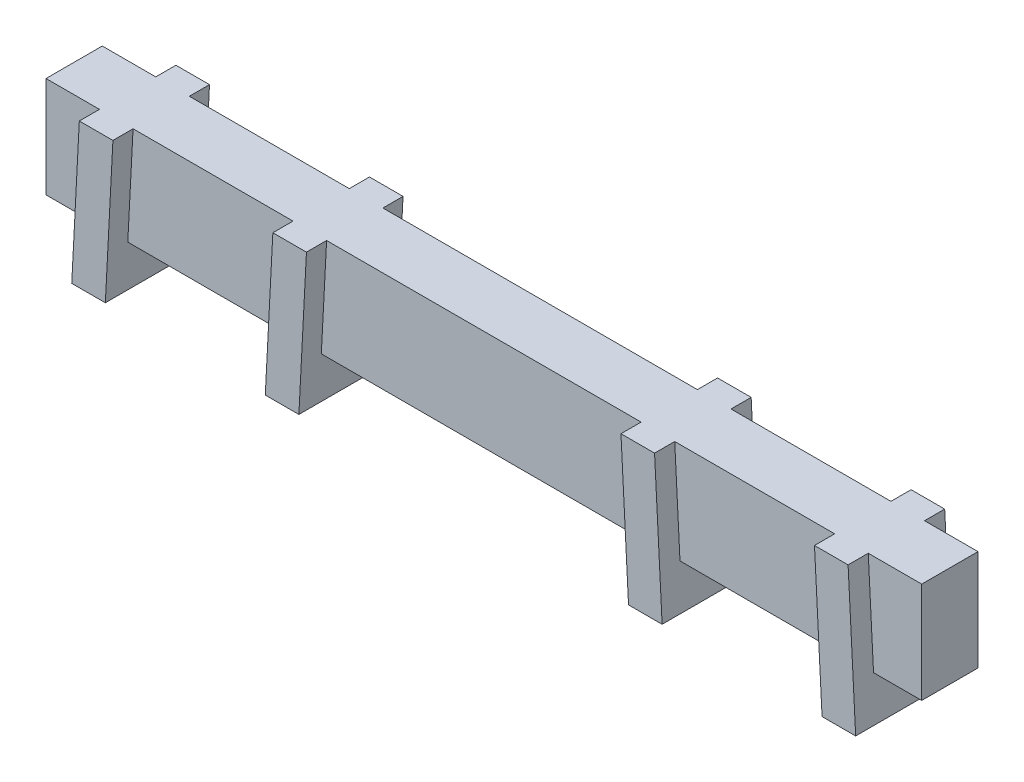
ISO-10303-21;
HEADER;
FILE_DESCRIPTION(('STEP AP214'),'2;1');
FILE_NAME('part.step','',(''),(''),'','','');
FILE_SCHEMA(('AUTOMOTIVE_DESIGN { 1 0 10303 214 1 1 1 1 }'));
ENDSEC;
DATA;
#1=APPLICATION_CONTEXT('core data for automotive mechanical design processes');
#2=APPLICATION_PROTOCOL_DEFINITION('international standard','automotive_design',2000,#1);
#3=PRODUCT_CONTEXT('',#1,'mechanical');
#4=PRODUCT('Part','Part','',(#3));
#5=PRODUCT_RELATED_PRODUCT_CATEGORY('part','',(#4));
#6=PRODUCT_DEFINITION_FORMATION('','',#4);
#7=PRODUCT_DEFINITION_CONTEXT('part definition',#1,'design');
#8=PRODUCT_DEFINITION('design','',#6,#7);
#9=PRODUCT_DEFINITION_SHAPE('','',#8);
#10=(LENGTH_UNIT() NAMED_UNIT(*) SI_UNIT(.MILLI.,.METRE.));
#11=(NAMED_UNIT(*) PLANE_ANGLE_UNIT() SI_UNIT($,.RADIAN.));
#12=(NAMED_UNIT(*) SI_UNIT($,.STERADIAN.) SOLID_ANGLE_UNIT());
#13=UNCERTAINTY_MEASURE_WITH_UNIT(LENGTH_MEASURE(1.E-05),#10,'distance_accuracy_value','');
#14=(GEOMETRIC_REPRESENTATION_CONTEXT(3) GLOBAL_UNCERTAINTY_ASSIGNED_CONTEXT((#13)) GLOBAL_UNIT_ASSIGNED_CONTEXT((#10,
#11,#12)) REPRESENTATION_CONTEXT('',''));
#15=CARTESIAN_POINT('',(0.,0.,0.));
#16=DIRECTION('',(0.,0.,1.));
#17=DIRECTION('',(1.,0.,0.));
#18=AXIS2_PLACEMENT_3D('',#15,#16,#17);
#19=CARTESIAN_POINT('',(0.,0.,0.));
#20=DIRECTION('',(0.,-1.,0.));
#21=DIRECTION('',(0.,0.,-1.));
#22=AXIS2_PLACEMENT_3D('',#19,#20,#21);
#23=PLANE('',#22);
#24=DIRECTION('',(-1.,0.,0.));
#25=VECTOR('',#24,1.);
#26=CARTESIAN_POINT('',(-33.10001,0.,0.));
#27=LINE('',#26,#25);
#28=CARTESIAN_POINT('',(-14.826996,0.,0.));
#29=VERTEX_POINT('',#28);
#30=CARTESIAN_POINT('',(-26.917396,0.,0.));
#31=VERTEX_POINT('',#30);
#32=EDGE_CURVE('E489',#29,#31,#27,.T.);
#33=ORIENTED_EDGE('',*,*,#32,.F.);
#34=DIRECTION('',(0.,0.,1.));
#35=VECTOR('',#34,1.);
#36=CARTESIAN_POINT('',(-14.826996,0.,0.));
#37=LINE('',#36,#35);
#38=CARTESIAN_POINT('',(-14.826996,0.,4.2545));
#39=VERTEX_POINT('',#38);
#40=EDGE_CURVE('E329',#29,#39,#37,.T.);
#41=ORIENTED_EDGE('',*,*,#40,.T.);
#42=DIRECTION('',(1.,0.,0.));
#43=VECTOR('',#42,1.);
#44=CARTESIAN_POINT('',(-33.10001,0.,4.2545));
#45=LINE('',#44,#43);
#46=CARTESIAN_POINT('',(-26.917396,0.,4.2545));
#47=VERTEX_POINT('',#46);
#48=EDGE_CURVE('E482',#47,#39,#45,.T.);
#49=ORIENTED_EDGE('',*,*,#48,.F.);
#50=DIRECTION('',(0.,0.,-1.));
#51=VECTOR('',#50,1.);
#52=CARTESIAN_POINT('',(-26.917396,0.,0.));
#53=LINE('',#52,#51);
#54=EDGE_CURVE('E501',#47,#31,#53,.T.);
#55=ORIENTED_EDGE('',*,*,#54,.T.);
#56=EDGE_LOOP('',(#33,#41,#49,#55));
#57=FACE_BOUND('',#56,.T.);
#58=ADVANCED_FACE('F36',(#57),#23,.T.);
#59=CARTESIAN_POINT('',(-12.286996,0.,4.2545));
#60=VERTEX_POINT('',#59);
#61=CARTESIAN_POINT('',(12.286996,0.,4.2545));
#62=VERTEX_POINT('',#61);
#63=EDGE_CURVE('E483',#60,#62,#45,.T.);
#64=ORIENTED_EDGE('',*,*,#63,.F.);
#65=DIRECTION('',(0.,0.,-1.));
#66=VECTOR('',#65,1.);
#67=CARTESIAN_POINT('',(-12.286996,0.,0.));
#68=LINE('',#67,#66);
#69=CARTESIAN_POINT('',(-12.286996,0.,0.));
#70=VERTEX_POINT('',#69);
#71=EDGE_CURVE('E327',#60,#70,#68,.T.);
#72=ORIENTED_EDGE('',*,*,#71,.T.);
#73=CARTESIAN_POINT('',(12.286996,0.,0.));
#74=VERTEX_POINT('',#73);
#75=EDGE_CURVE('E570',#74,#70,#27,.T.);
#76=ORIENTED_EDGE('',*,*,#75,.F.);
#77=DIRECTION('',(0.,0.,1.));
#78=VECTOR('',#77,1.);
#79=CARTESIAN_POINT('',(12.286996,0.,0.));
#80=LINE('',#79,#78);
#81=EDGE_CURVE('E417',#74,#62,#80,.T.);
#82=ORIENTED_EDGE('',*,*,#81,.T.);
#83=EDGE_LOOP('',(#64,#72,#76,#82));
#84=FACE_BOUND('',#83,.T.);
#85=ADVANCED_FACE('F649',(#84),#23,.T.);
#86=CARTESIAN_POINT('',(-33.10001,7.62,0.));
#87=DIRECTION('',(0.,0.,1.));
#88=DIRECTION('',(1.,0.,0.));
#89=AXIS2_PLACEMENT_3D('',#86,#87,#88);
#90=PLANE('',#89);
#91=DIRECTION('',(0.052335956242944,0.998629534754574,0.));
#92=VECTOR('',#91,1.);
#93=CARTESIAN_POINT('',(-14.4787932962648,6.64410338500896,0.));
#94=LINE('',#93,#92);
#95=CARTESIAN_POINT('',(-14.4276487218632,7.62,0.));
#96=VERTEX_POINT('',#95);
#97=EDGE_CURVE('E51',#29,#96,#94,.T.);
#98=ORIENTED_EDGE('',*,*,#97,.F.);
#99=ORIENTED_EDGE('',*,*,#32,.T.);
#100=DIRECTION('',(-0.0523359562429441,-0.998629534754574,0.));
#101=VECTOR('',#100,1.);
#102=CARTESIAN_POINT('',(-26.536077058145,7.27599885115458,0.));
#103=LINE('',#102,#101);
#104=CARTESIAN_POINT('',(-26.5180487218632,7.62,0.));
#105=VERTEX_POINT('',#104);
#106=EDGE_CURVE('E442',#105,#31,#103,.T.);
#107=ORIENTED_EDGE('',*,*,#106,.F.);
#108=DIRECTION('',(-1.,0.,0.));
#109=VECTOR('',#108,1.);
#110=CARTESIAN_POINT('',(-33.10001,7.62,0.));
#111=LINE('',#110,#109);
#112=EDGE_CURVE('E566',#96,#105,#111,.T.);
#113=ORIENTED_EDGE('',*,*,#112,.F.);
#114=EDGE_LOOP('',(#98,#99,#107,#113));
#115=FACE_BOUND('',#114,.T.);
#116=ADVANCED_FACE('F590',(#115),#90,.F.);
#117=ORIENTED_EDGE('',*,*,#75,.T.);
#118=DIRECTION('',(0.052335956242944,0.998629534754574,0.));
#119=VECTOR('',#118,1.);
#120=CARTESIAN_POINT('',(-11.945750489147,6.51135223665904,0.));
#121=LINE('',#120,#119);
#122=CARTESIAN_POINT('',(-11.8876487218632,7.62,0.));
#123=VERTEX_POINT('',#122);
#124=EDGE_CURVE('E59',#70,#123,#121,.T.);
#125=ORIENTED_EDGE('',*,*,#124,.T.);
#126=CARTESIAN_POINT('',(11.8876487218632,7.62,0.));
#127=VERTEX_POINT('',#126);
#128=EDGE_CURVE('E563',#127,#123,#111,.T.);
#129=ORIENTED_EDGE('',*,*,#128,.F.);
#130=DIRECTION('',(-0.052335956242944,0.998629534754574,0.));
#131=VECTOR('',#130,1.);
#132=CARTESIAN_POINT('',(11.7644251710559,9.97124541610301,0.));
#133=LINE('',#132,#131);
#134=EDGE_CURVE('E420',#74,#127,#133,.T.);
#135=ORIENTED_EDGE('',*,*,#134,.F.);
#136=EDGE_LOOP('',(#117,#125,#129,#135));
#137=FACE_BOUND('',#136,.T.);
#138=ADVANCED_FACE('F568',(#137),#90,.F.);
#139=CARTESIAN_POINT('',(-33.10001,7.62,4.2545));
#140=DIRECTION('',(0.,0.,-1.));
#141=DIRECTION('',(-1.,0.,0.));
#142=AXIS2_PLACEMENT_3D('',#139,#140,#141);
#143=PLANE('',#142);
#144=ORIENTED_EDGE('',*,*,#48,.T.);
#145=DIRECTION('',(-0.052335956242944,-0.998629534754574,0.));
#146=VECTOR('',#145,1.);
#147=CARTESIAN_POINT('',(-14.4787932962648,6.64410338500896,4.2545));
#148=LINE('',#147,#146);
#149=CARTESIAN_POINT('',(-14.4276487218632,7.62,4.2545));
#150=VERTEX_POINT('',#149);
#151=EDGE_CURVE('E507',#150,#39,#148,.T.);
#152=ORIENTED_EDGE('',*,*,#151,.F.);
#153=DIRECTION('',(1.,0.,0.));
#154=VECTOR('',#153,1.);
#155=CARTESIAN_POINT('',(-33.10001,7.62,4.2545));
#156=LINE('',#155,#154);
#157=CARTESIAN_POINT('',(-26.5180487218632,7.62,4.2545));
#158=VERTEX_POINT('',#157);
#159=EDGE_CURVE('E467',#158,#150,#156,.T.);
#160=ORIENTED_EDGE('',*,*,#159,.F.);
#161=DIRECTION('',(0.0523359562429441,0.998629534754574,0.));
#162=VECTOR('',#161,1.);
#163=CARTESIAN_POINT('',(-26.536077058145,7.27599885115458,4.2545));
#164=LINE('',#163,#162);
#165=EDGE_CURVE('E448',#47,#158,#164,.T.);
#166=ORIENTED_EDGE('',*,*,#165,.F.);
#167=EDGE_LOOP('',(#144,#152,#160,#166));
#168=FACE_BOUND('',#167,.T.);
#169=ADVANCED_FACE('F536',(#168),#143,.F.);
#170=DIRECTION('',(-0.052335956242944,-0.998629534754574,0.));
#171=VECTOR('',#170,1.);
#172=CARTESIAN_POINT('',(-11.945750489147,6.51135223665904,4.2545));
#173=LINE('',#172,#171);
#174=CARTESIAN_POINT('',(-11.8876487218632,7.62,4.2545));
#175=VERTEX_POINT('',#174);
#176=EDGE_CURVE('E509',#175,#60,#173,.T.);
#177=ORIENTED_EDGE('',*,*,#176,.T.);
#178=ORIENTED_EDGE('',*,*,#63,.T.);
#179=DIRECTION('',(0.052335956242944,-0.998629534754574,0.));
#180=VECTOR('',#179,1.);
#181=CARTESIAN_POINT('',(11.7644251710559,9.97124541610301,4.2545));
#182=LINE('',#181,#180);
#183=CARTESIAN_POINT('',(11.8876487218633,7.62,4.2545));
#184=VERTEX_POINT('',#183);
#185=EDGE_CURVE('E514',#184,#62,#182,.T.);
#186=ORIENTED_EDGE('',*,*,#185,.F.);
#187=EDGE_CURVE('E609',#175,#184,#156,.T.);
#188=ORIENTED_EDGE('',*,*,#187,.F.);
#189=EDGE_LOOP('',(#177,#178,#186,#188));
#190=FACE_BOUND('',#189,.T.);
#191=ADVANCED_FACE('F662',(#190),#143,.F.);
#192=CARTESIAN_POINT('',(-29.3836678441492,1.40681701952345,0.));
#193=DIRECTION('',(-0.998629534754574,0.0523359562429441,0.));
#194=DIRECTION('',(-0.0523359562429441,-0.998629534754574,0.));
#195=AXIS2_PLACEMENT_3D('',#192,#193,#194);
#196=PLANE('',#195);
#197=DIRECTION('',(0.0523359562429441,0.998629534754574,0.));
#198=VECTOR('',#197,1.);
#199=CARTESIAN_POINT('',(-29.4743305031948,-0.32312957019854,5.77850000000003));
#200=LINE('',#199,#198);
#201=CARTESIAN_POINT('',(-29.6302347112784,-3.29795907483336,5.77850000000003));
#202=VERTEX_POINT('',#201);
#203=CARTESIAN_POINT('',(-29.0580487218632,7.62,5.77850000000003));
#204=VERTEX_POINT('',#203);
#205=EDGE_CURVE('E436',#202,#204,#200,.T.);
#206=ORIENTED_EDGE('',*,*,#205,.T.);
#207=DIRECTION('',(0.,0.,-1.));
#208=VECTOR('',#207,1.);
#209=CARTESIAN_POINT('',(-29.0580487218632,7.62,0.));
#210=LINE('',#209,#208);
#211=CARTESIAN_POINT('',(-29.0580487218632,7.62,4.2545));
#212=VERTEX_POINT('',#211);
#213=EDGE_CURVE('E386',#204,#212,#210,.T.);
#214=ORIENTED_EDGE('',*,*,#213,.T.);
#215=DIRECTION('',(0.0523359562429441,0.998629534754574,0.));
#216=VECTOR('',#215,1.);
#217=CARTESIAN_POINT('',(-29.0691198652628,7.4087499995045,4.2545));
#218=LINE('',#217,#216);
#219=CARTESIAN_POINT('',(-29.457396,0.,4.2545));
#220=VERTEX_POINT('',#219);
#221=EDGE_CURVE('E454',#220,#212,#218,.T.);
#222=ORIENTED_EDGE('',*,*,#221,.F.);
#223=DIRECTION('',(0.,0.,-1.));
#224=VECTOR('',#223,1.);
#225=CARTESIAN_POINT('',(-29.457396,0.,0.));
#226=LINE('',#225,#224);
#227=CARTESIAN_POINT('',(-29.457396,0.,0.));
#228=VERTEX_POINT('',#227);
#229=EDGE_CURVE('E504',#220,#228,#226,.T.);
#230=ORIENTED_EDGE('',*,*,#229,.T.);
#231=DIRECTION('',(-0.0523359562429441,-0.998629534754574,0.));
#232=VECTOR('',#231,1.);
#233=CARTESIAN_POINT('',(-29.0691198652628,7.4087499995045,0.));
#234=LINE('',#233,#232);
#235=CARTESIAN_POINT('',(-29.0580487218632,7.62,0.));
#236=VERTEX_POINT('',#235);
#237=EDGE_CURVE('E451',#236,#228,#234,.T.);
#238=ORIENTED_EDGE('',*,*,#237,.F.);
#239=CARTESIAN_POINT('',(-29.0580487218632,7.62,-1.52399999999997));
#240=VERTEX_POINT('',#239);
#241=EDGE_CURVE('E383',#236,#240,#210,.T.);
#242=ORIENTED_EDGE('',*,*,#241,.T.);
#243=DIRECTION('',(-0.0523359562429441,-0.998629534754574,0.));
#244=VECTOR('',#243,1.);
#245=CARTESIAN_POINT('',(-29.4743305031948,-0.323129570198541,-1.52399999999997));
#246=LINE('',#245,#244);
#247=CARTESIAN_POINT('',(-29.6302347112784,-3.29795907483336,-1.52399999999997));
#248=VERTEX_POINT('',#247);
#249=EDGE_CURVE('E439',#240,#248,#246,.T.);
#250=ORIENTED_EDGE('',*,*,#249,.T.);
#251=DIRECTION('',(0.,0.,-1.));
#252=VECTOR('',#251,1.);
#253=CARTESIAN_POINT('',(-29.6302347112784,-3.29795907483336,5.77850000000003));
#254=LINE('',#253,#252);
#255=EDGE_CURVE('E332',#202,#248,#254,.T.);
#256=ORIENTED_EDGE('',*,*,#255,.F.);
#257=EDGE_LOOP('',(#206,#214,#222,#230,#238,#242,#250,#256));
#258=FACE_BOUND('',#257,.T.);
#259=ADVANCED_FACE('F605',(#258),#196,.T.);
#260=CARTESIAN_POINT('',(-26.8436678441492,1.40681701952345,0.));
#261=DIRECTION('',(-0.998629534754574,0.0523359562429441,0.));
#262=DIRECTION('',(-0.0523359562429441,-0.998629534754574,0.));
#263=AXIS2_PLACEMENT_3D('',#260,#261,#262);
#264=PLANE('',#263);
#265=DIRECTION('',(0.,0.,-1.));
#266=VECTOR('',#265,1.);
#267=CARTESIAN_POINT('',(-26.5180487218632,7.62,0.));
#268=LINE('',#267,#266);
#269=CARTESIAN_POINT('',(-26.5180487218632,7.62,5.77850000000003));
#270=VERTEX_POINT('',#269);
#271=EDGE_CURVE('E382',#270,#158,#268,.T.);
#272=ORIENTED_EDGE('',*,*,#271,.F.);
#273=DIRECTION('',(0.0523359562429441,0.998629534754574,0.));
#274=VECTOR('',#273,1.);
#275=CARTESIAN_POINT('',(-26.9343305031948,-0.32312957019854,5.77850000000003));
#276=LINE('',#275,#274);
#277=CARTESIAN_POINT('',(-27.0902347112784,-3.29795907483336,5.77850000000003));
#278=VERTEX_POINT('',#277);
#279=EDGE_CURVE('E435',#278,#270,#276,.T.);
#280=ORIENTED_EDGE('',*,*,#279,.F.);
#281=DIRECTION('',(0.,0.,1.));
#282=VECTOR('',#281,1.);
#283=CARTESIAN_POINT('',(-27.0902347112784,-3.29795907483336,5.77850000000003));
#284=LINE('',#283,#282);
#285=CARTESIAN_POINT('',(-27.0902347112784,-3.29795907483336,-1.52399999999997));
#286=VERTEX_POINT('',#285);
#287=EDGE_CURVE('E338',#286,#278,#284,.T.);
#288=ORIENTED_EDGE('',*,*,#287,.F.);
#289=DIRECTION('',(-0.0523359562429441,-0.998629534754574,0.));
#290=VECTOR('',#289,1.);
#291=CARTESIAN_POINT('',(-26.9343305031948,-0.323129570198541,-1.52399999999997));
#292=LINE('',#291,#290);
#293=CARTESIAN_POINT('',(-26.5180487218632,7.62,-1.52399999999997));
#294=VERTEX_POINT('',#293);
#295=EDGE_CURVE('E440',#294,#286,#292,.T.);
#296=ORIENTED_EDGE('',*,*,#295,.F.);
#297=EDGE_CURVE('E380',#105,#294,#268,.T.);
#298=ORIENTED_EDGE('',*,*,#297,.F.);
#299=ORIENTED_EDGE('',*,*,#106,.T.);
#300=ORIENTED_EDGE('',*,*,#54,.F.);
#301=ORIENTED_EDGE('',*,*,#165,.T.);
#302=EDGE_LOOP('',(#272,#280,#288,#296,#298,#299,#300,#301));
#303=FACE_BOUND('',#302,.T.);
#304=ADVANCED_FACE('F593',(#303),#264,.F.);
#305=CARTESIAN_POINT('',(-29.4743305031948,-0.32312957019854,5.77850000000003));
#306=DIRECTION('',(0.,0.,-1.));
#307=DIRECTION('',(0.,1.,0.));
#308=AXIS2_PLACEMENT_3D('',#305,#306,#307);
#309=PLANE('',#308);
#310=DIRECTION('',(1.,0.,0.));
#311=VECTOR('',#310,1.);
#312=CARTESIAN_POINT('',(-29.4743305031948,7.62,5.77850000000002));
#313=LINE('',#312,#311);
#314=EDGE_CURVE('E387',#204,#270,#313,.T.);
#315=ORIENTED_EDGE('',*,*,#314,.F.);
#316=ORIENTED_EDGE('',*,*,#205,.F.);
#317=DIRECTION('',(-1.,0.,0.));
#318=VECTOR('',#317,1.);
#319=CARTESIAN_POINT('',(-29.6302347112784,-3.29795907483336,5.77850000000003));
#320=LINE('',#319,#318);
#321=EDGE_CURVE('E341',#278,#202,#320,.T.);
#322=ORIENTED_EDGE('',*,*,#321,.F.);
#323=ORIENTED_EDGE('',*,*,#279,.T.);
#324=EDGE_LOOP('',(#315,#316,#322,#323));
#325=FACE_BOUND('',#324,.T.);
#326=ADVANCED_FACE('F608',(#325),#309,.F.);
#327=CARTESIAN_POINT('',(-29.4743305031948,-0.323129570198541,-1.52399999999997));
#328=DIRECTION('',(0.,0.,1.));
#329=DIRECTION('',(1.,0.,0.));
#330=AXIS2_PLACEMENT_3D('',#327,#328,#329);
#331=PLANE('',#330);
#332=DIRECTION('',(-1.,0.,0.));
#333=VECTOR('',#332,1.);
#334=CARTESIAN_POINT('',(-29.4743305031948,7.62,-1.52399999999997));
#335=LINE('',#334,#333);
#336=EDGE_CURVE('E365',#294,#240,#335,.T.);
#337=ORIENTED_EDGE('',*,*,#336,.F.);
#338=ORIENTED_EDGE('',*,*,#295,.T.);
#339=DIRECTION('',(1.,0.,0.));
#340=VECTOR('',#339,1.);
#341=CARTESIAN_POINT('',(-29.6302347112784,-3.29795907483336,-1.52399999999997));
#342=LINE('',#341,#340);
#343=EDGE_CURVE('E335',#248,#286,#342,.T.);
#344=ORIENTED_EDGE('',*,*,#343,.F.);
#345=ORIENTED_EDGE('',*,*,#249,.F.);
#346=EDGE_LOOP('',(#337,#338,#344,#345));
#347=FACE_BOUND('',#346,.T.);
#348=ADVANCED_FACE('F598',(#347),#331,.F.);
#349=CARTESIAN_POINT('',(-12.2463840822689,0.774921553377825,0.));
#350=DIRECTION('',(0.998629534754574,-0.052335956242944,0.));
#351=DIRECTION('',(0.052335956242944,0.998629534754574,0.));
#352=AXIS2_PLACEMENT_3D('',#349,#350,#351);
#353=PLANE('',#352);
#354=ORIENTED_EDGE('',*,*,#176,.F.);
#355=DIRECTION('',(0.,0.,1.));
#356=VECTOR('',#355,1.);
#357=CARTESIAN_POINT('',(-11.8876487218632,7.62,0.));
#358=LINE('',#357,#356);
#359=CARTESIAN_POINT('',(-11.8876487218632,7.62,5.7785));
#360=VERTEX_POINT('',#359);
#361=EDGE_CURVE('E367',#175,#360,#358,.T.);
#362=ORIENTED_EDGE('',*,*,#361,.T.);
#363=DIRECTION('',(0.052335956242944,0.998629534754574,0.));
#364=VECTOR('',#363,1.);
#365=CARTESIAN_POINT('',(-12.1482847010819,2.64676925478857,5.7785));
#366=LINE('',#365,#364);
#367=CARTESIAN_POINT('',(-12.4596145572652,-3.29375828601527,5.7785));
#368=VERTEX_POINT('',#367);
#369=EDGE_CURVE('E426',#368,#360,#366,.T.);
#370=ORIENTED_EDGE('',*,*,#369,.F.);
#371=DIRECTION('',(0.,0.,1.));
#372=VECTOR('',#371,1.);
#373=CARTESIAN_POINT('',(-12.4596145572652,-3.29375828601527,5.7785));
#374=LINE('',#373,#372);
#375=CARTESIAN_POINT('',(-12.4596145572652,-3.29375828601527,-1.524));
#376=VERTEX_POINT('',#375);
#377=EDGE_CURVE('E321',#376,#368,#374,.T.);
#378=ORIENTED_EDGE('',*,*,#377,.F.);
#379=DIRECTION('',(-0.052335956242944,-0.998629534754574,0.));
#380=VECTOR('',#379,1.);
#381=CARTESIAN_POINT('',(-12.1482847010819,2.64676925478857,-1.524));
#382=LINE('',#381,#380);
#383=CARTESIAN_POINT('',(-11.8876487218632,7.62,-1.524));
#384=VERTEX_POINT('',#383);
#385=EDGE_CURVE('E424',#384,#376,#382,.T.);
#386=ORIENTED_EDGE('',*,*,#385,.F.);
#387=EDGE_CURVE('E363',#384,#123,#358,.T.);
#388=ORIENTED_EDGE('',*,*,#387,.T.);
#389=ORIENTED_EDGE('',*,*,#124,.F.);
#390=ORIENTED_EDGE('',*,*,#71,.F.);
#391=EDGE_LOOP('',(#354,#362,#370,#378,#386,#388,#389,#390));
#392=FACE_BOUND('',#391,.T.);
#393=ADVANCED_FACE('F553',(#392),#353,.T.);
#394=CARTESIAN_POINT('',(-14.7863840822689,0.774921553377825,0.));
#395=DIRECTION('',(0.998629534754574,-0.052335956242944,0.));
#396=DIRECTION('',(0.052335956242944,0.998629534754574,0.));
#397=AXIS2_PLACEMENT_3D('',#394,#395,#396);
#398=PLANE('',#397);
#399=DIRECTION('',(0.,0.,1.));
#400=VECTOR('',#399,1.);
#401=CARTESIAN_POINT('',(-14.4276487218632,7.62,0.));
#402=LINE('',#401,#400);
#403=CARTESIAN_POINT('',(-14.4276487218632,7.62,5.7785));
#404=VERTEX_POINT('',#403);
#405=EDGE_CURVE('E374',#150,#404,#402,.T.);
#406=ORIENTED_EDGE('',*,*,#405,.F.);
#407=ORIENTED_EDGE('',*,*,#151,.T.);
#408=ORIENTED_EDGE('',*,*,#40,.F.);
#409=ORIENTED_EDGE('',*,*,#97,.T.);
#410=CARTESIAN_POINT('',(-14.4276487218632,7.62,-1.524));
#411=VERTEX_POINT('',#410);
#412=EDGE_CURVE('E376',#411,#96,#402,.T.);
#413=ORIENTED_EDGE('',*,*,#412,.F.);
#414=DIRECTION('',(-0.052335956242944,-0.998629534754574,0.));
#415=VECTOR('',#414,1.);
#416=CARTESIAN_POINT('',(-14.6882847010819,2.64676925478857,-1.524));
#417=LINE('',#416,#415);
#418=CARTESIAN_POINT('',(-14.9996145572652,-3.29375828601527,-1.524));
#419=VERTEX_POINT('',#418);
#420=EDGE_CURVE('E423',#411,#419,#417,.T.);
#421=ORIENTED_EDGE('',*,*,#420,.T.);
#422=DIRECTION('',(0.,0.,-1.));
#423=VECTOR('',#422,1.);
#424=CARTESIAN_POINT('',(-14.9996145572652,-3.29375828601527,5.7785));
#425=LINE('',#424,#423);
#426=CARTESIAN_POINT('',(-14.9996145572652,-3.29375828601527,5.7785));
#427=VERTEX_POINT('',#426);
#428=EDGE_CURVE('E315',#427,#419,#425,.T.);
#429=ORIENTED_EDGE('',*,*,#428,.F.);
#430=DIRECTION('',(0.052335956242944,0.998629534754574,0.));
#431=VECTOR('',#430,1.);
#432=CARTESIAN_POINT('',(-14.6882847010819,2.64676925478857,5.7785));
#433=LINE('',#432,#431);
#434=EDGE_CURVE('E427',#427,#404,#433,.T.);
#435=ORIENTED_EDGE('',*,*,#434,.T.);
#436=EDGE_LOOP('',(#406,#407,#408,#409,#413,#421,#429,#435));
#437=FACE_BOUND('',#436,.T.);
#438=ADVANCED_FACE('F542',(#437),#398,.F.);
#439=CARTESIAN_POINT('',(-12.1482847010819,2.64676925478857,-1.524));
#440=DIRECTION('',(0.,0.,-1.));
#441=DIRECTION('',(-1.,0.,0.));
#442=AXIS2_PLACEMENT_3D('',#439,#440,#441);
#443=PLANE('',#442);
#444=ORIENTED_EDGE('',*,*,#420,.F.);
#445=DIRECTION('',(1.,0.,0.));
#446=VECTOR('',#445,1.);
#447=CARTESIAN_POINT('',(-12.1482847010819,7.62,-1.524));
#448=LINE('',#447,#446);
#449=EDGE_CURVE('E366',#411,#384,#448,.T.);
#450=ORIENTED_EDGE('',*,*,#449,.T.);
#451=ORIENTED_EDGE('',*,*,#385,.T.);
#452=DIRECTION('',(1.,0.,0.));
#453=VECTOR('',#452,1.);
#454=CARTESIAN_POINT('',(-14.9996145572652,-3.29375828601527,-1.524));
#455=LINE('',#454,#453);
#456=EDGE_CURVE('E318',#419,#376,#455,.T.);
#457=ORIENTED_EDGE('',*,*,#456,.F.);
#458=EDGE_LOOP('',(#444,#450,#451,#457));
#459=FACE_BOUND('',#458,.T.);
#460=ADVANCED_FACE('F560',(#459),#443,.T.);
#461=CARTESIAN_POINT('',(-12.1482847010819,2.64676925478857,5.7785));
#462=DIRECTION('',(0.,0.,1.));
#463=DIRECTION('',(1.,0.,0.));
#464=AXIS2_PLACEMENT_3D('',#461,#462,#463);
#465=PLANE('',#464);
#466=ORIENTED_EDGE('',*,*,#369,.T.);
#467=DIRECTION('',(-1.,0.,0.));
#468=VECTOR('',#467,1.);
#469=CARTESIAN_POINT('',(-12.1482847010819,7.62,5.7785));
#470=LINE('',#469,#468);
#471=EDGE_CURVE('E371',#360,#404,#470,.T.);
#472=ORIENTED_EDGE('',*,*,#471,.T.);
#473=ORIENTED_EDGE('',*,*,#434,.F.);
#474=DIRECTION('',(-1.,0.,0.));
#475=VECTOR('',#474,1.);
#476=CARTESIAN_POINT('',(-14.9996145572652,-3.29375828601527,5.7785));
#477=LINE('',#476,#475);
#478=EDGE_CURVE('E324',#368,#427,#477,.T.);
#479=ORIENTED_EDGE('',*,*,#478,.F.);
#480=EDGE_LOOP('',(#466,#472,#473,#479));
#481=FACE_BOUND('',#480,.T.);
#482=ADVANCED_FACE('F549',(#481),#465,.T.);
#483=CARTESIAN_POINT('',(12.2463840822689,0.774921553377825,0.));
#484=DIRECTION('',(0.998629534754574,0.052335956242944,0.));
#485=DIRECTION('',(-0.052335956242944,0.998629534754574,0.));
#486=AXIS2_PLACEMENT_3D('',#483,#484,#485);
#487=PLANE('',#486);
#488=DIRECTION('',(0.,0.,1.));
#489=VECTOR('',#488,1.);
#490=CARTESIAN_POINT('',(11.8876487218632,7.62,0.));
#491=LINE('',#490,#489);
#492=CARTESIAN_POINT('',(11.8876487218632,7.62,-1.524));
#493=VERTEX_POINT('',#492);
#494=EDGE_CURVE('E359',#493,#127,#491,.T.);
#495=ORIENTED_EDGE('',*,*,#494,.F.);
#496=DIRECTION('',(-0.052335956242944,0.998629534754574,0.));
#497=VECTOR('',#496,1.);
#498=CARTESIAN_POINT('',(11.7914870166853,9.45487464062609,-1.524));
#499=LINE('',#498,#497);
#500=CARTESIAN_POINT('',(12.4600353141733,-3.30178680609067,-1.524));
#501=VERTEX_POINT('',#500);
#502=EDGE_CURVE('E405',#501,#493,#499,.T.);
#503=ORIENTED_EDGE('',*,*,#502,.F.);
#504=DIRECTION('',(0.,0.,-1.));
#505=VECTOR('',#504,1.);
#506=CARTESIAN_POINT('',(12.4600353141733,-3.30178680609067,5.7785));
#507=LINE('',#506,#505);
#508=CARTESIAN_POINT('',(12.4600353141733,-3.30178680609067,5.7785));
#509=VERTEX_POINT('',#508);
#510=EDGE_CURVE('E303',#509,#501,#507,.T.);
#511=ORIENTED_EDGE('',*,*,#510,.F.);
#512=DIRECTION('',(0.052335956242944,-0.998629534754574,0.));
#513=VECTOR('',#512,1.);
#514=CARTESIAN_POINT('',(11.7914870166853,9.45487464062609,5.7785));
#515=LINE('',#514,#513);
#516=CARTESIAN_POINT('',(11.8876487218632,7.62,5.7785));
#517=VERTEX_POINT('',#516);
#518=EDGE_CURVE('E403',#517,#509,#515,.T.);
#519=ORIENTED_EDGE('',*,*,#518,.F.);
#520=EDGE_CURVE('E362',#184,#517,#491,.T.);
#521=ORIENTED_EDGE('',*,*,#520,.F.);
#522=ORIENTED_EDGE('',*,*,#185,.T.);
#523=ORIENTED_EDGE('',*,*,#81,.F.);
#524=ORIENTED_EDGE('',*,*,#134,.T.);
#525=EDGE_LOOP('',(#495,#503,#511,#519,#521,#522,#523,#524));
#526=FACE_BOUND('',#525,.T.);
#527=ADVANCED_FACE('F664',(#526),#487,.F.);
#528=CARTESIAN_POINT('',(14.7863840822689,0.774921553377825,0.));
#529=DIRECTION('',(0.998629534754574,0.052335956242944,0.));
#530=DIRECTION('',(-0.052335956242944,0.998629534754574,0.));
#531=AXIS2_PLACEMENT_3D('',#528,#529,#530);
#532=PLANE('',#531);
#533=DIRECTION('',(-0.052335956242944,0.998629534754574,0.));
#534=VECTOR('',#533,1.);
#535=CARTESIAN_POINT('',(14.3314870166853,9.45487464062609,-1.524));
#536=LINE('',#535,#534);
#537=CARTESIAN_POINT('',(15.0000353141733,-3.30178680609067,-1.524));
#538=VERTEX_POINT('',#537);
#539=CARTESIAN_POINT('',(14.4276487218632,7.62,-1.524));
#540=VERTEX_POINT('',#539);
#541=EDGE_CURVE('E406',#538,#540,#536,.T.);
#542=ORIENTED_EDGE('',*,*,#541,.T.);
#543=DIRECTION('',(0.,0.,1.));
#544=VECTOR('',#543,1.);
#545=CARTESIAN_POINT('',(14.4276487218632,7.62,0.));
#546=LINE('',#545,#544);
#547=CARTESIAN_POINT('',(14.4276487218632,7.62,0.));
#548=VERTEX_POINT('',#547);
#549=EDGE_CURVE('E357',#540,#548,#546,.T.);
#550=ORIENTED_EDGE('',*,*,#549,.T.);
#551=DIRECTION('',(-0.052335956242944,0.998629534754574,0.));
#552=VECTOR('',#551,1.);
#553=CARTESIAN_POINT('',(14.2974679781736,10.1039965644529,0.));
#554=LINE('',#553,#552);
#555=CARTESIAN_POINT('',(14.826996,0.,0.));
#556=VERTEX_POINT('',#555);
#557=EDGE_CURVE('E414',#556,#548,#554,.T.);
#558=ORIENTED_EDGE('',*,*,#557,.F.);
#559=DIRECTION('',(0.,0.,1.));
#560=VECTOR('',#559,1.);
#561=CARTESIAN_POINT('',(14.826996,0.,0.));
#562=LINE('',#561,#560);
#563=CARTESIAN_POINT('',(14.826996,0.,4.2545));
#564=VERTEX_POINT('',#563);
#565=EDGE_CURVE('E409',#556,#564,#562,.T.);
#566=ORIENTED_EDGE('',*,*,#565,.T.);
#567=DIRECTION('',(0.052335956242944,-0.998629534754574,0.));
#568=VECTOR('',#567,1.);
#569=CARTESIAN_POINT('',(14.2974679781736,10.1039965644529,4.2545));
#570=LINE('',#569,#568);
#571=CARTESIAN_POINT('',(14.4276487218632,7.62,4.2545));
#572=VERTEX_POINT('',#571);
#573=EDGE_CURVE('E511',#572,#564,#570,.T.);
#574=ORIENTED_EDGE('',*,*,#573,.F.);
#575=CARTESIAN_POINT('',(14.4276487218632,7.62,5.7785));
#576=VERTEX_POINT('',#575);
#577=EDGE_CURVE('E360',#572,#576,#546,.T.);
#578=ORIENTED_EDGE('',*,*,#577,.T.);
#579=DIRECTION('',(0.052335956242944,-0.998629534754574,0.));
#580=VECTOR('',#579,1.);
#581=CARTESIAN_POINT('',(14.3314870166853,9.45487464062609,5.7785));
#582=LINE('',#581,#580);
#583=CARTESIAN_POINT('',(15.0000353141733,-3.30178680609067,5.7785));
#584=VERTEX_POINT('',#583);
#585=EDGE_CURVE('E402',#576,#584,#582,.T.);
#586=ORIENTED_EDGE('',*,*,#585,.T.);
#587=DIRECTION('',(0.,0.,1.));
#588=VECTOR('',#587,1.);
#589=CARTESIAN_POINT('',(15.0000353141733,-3.30178680609067,5.7785));
#590=LINE('',#589,#588);
#591=EDGE_CURVE('E309',#538,#584,#590,.T.);
#592=ORIENTED_EDGE('',*,*,#591,.F.);
#593=EDGE_LOOP('',(#542,#550,#558,#566,#574,#578,#586,#592));
#594=FACE_BOUND('',#593,.T.);
#595=ADVANCED_FACE('F674',(#594),#532,.T.);
#596=CARTESIAN_POINT('',(11.7914870166853,9.45487464062609,5.7785));
#597=DIRECTION('',(0.,0.,1.));
#598=DIRECTION('',(0.,-1.,0.));
#599=AXIS2_PLACEMENT_3D('',#596,#597,#598);
#600=PLANE('',#599);
#601=ORIENTED_EDGE('',*,*,#585,.F.);
#602=DIRECTION('',(-1.,0.,0.));
#603=VECTOR('',#602,1.);
#604=CARTESIAN_POINT('',(11.7914870166853,7.62,5.7785));
#605=LINE('',#604,#603);
#606=EDGE_CURVE('E368',#576,#517,#605,.T.);
#607=ORIENTED_EDGE('',*,*,#606,.T.);
#608=ORIENTED_EDGE('',*,*,#518,.T.);
#609=DIRECTION('',(-1.,0.,0.));
#610=VECTOR('',#609,1.);
#611=CARTESIAN_POINT('',(12.4600353141733,-3.30178680609067,5.7785));
#612=LINE('',#611,#610);
#613=EDGE_CURVE('E312',#584,#509,#612,.T.);
#614=ORIENTED_EDGE('',*,*,#613,.F.);
#615=EDGE_LOOP('',(#601,#607,#608,#614));
#616=FACE_BOUND('',#615,.T.);
#617=ADVANCED_FACE('F670',(#616),#600,.T.);
#618=CARTESIAN_POINT('',(11.7914870166853,9.45487464062609,-1.524));
#619=DIRECTION('',(0.,0.,-1.));
#620=DIRECTION('',(0.,1.,0.));
#621=AXIS2_PLACEMENT_3D('',#618,#619,#620);
#622=PLANE('',#621);
#623=ORIENTED_EDGE('',*,*,#502,.T.);
#624=DIRECTION('',(1.,0.,0.));
#625=VECTOR('',#624,1.);
#626=CARTESIAN_POINT('',(11.7914870166853,7.62,-1.524));
#627=LINE('',#626,#625);
#628=EDGE_CURVE('E354',#493,#540,#627,.T.);
#629=ORIENTED_EDGE('',*,*,#628,.T.);
#630=ORIENTED_EDGE('',*,*,#541,.F.);
#631=DIRECTION('',(1.,0.,0.));
#632=VECTOR('',#631,1.);
#633=CARTESIAN_POINT('',(12.4600353141733,-3.30178680609067,-1.524));
#634=LINE('',#633,#632);
#635=EDGE_CURVE('E306',#501,#538,#634,.T.);
#636=ORIENTED_EDGE('',*,*,#635,.F.);
#637=EDGE_LOOP('',(#623,#629,#630,#636));
#638=FACE_BOUND('',#637,.T.);
#639=ADVANCED_FACE('F679',(#638),#622,.T.);
#640=CARTESIAN_POINT('',(29.3836678441492,1.40681701952345,0.));
#641=DIRECTION('',(0.998629534754574,0.0523359562429441,0.));
#642=DIRECTION('',(-0.0523359562429441,0.998629534754574,0.));
#643=AXIS2_PLACEMENT_3D('',#640,#641,#642);
#644=PLANE('',#643);
#645=DIRECTION('',(-0.0523359562429441,0.998629534754574,0.));
#646=VECTOR('',#645,1.);
#647=CARTESIAN_POINT('',(28.8096638589094,12.3594655211846,-1.52400000000001));
#648=LINE('',#647,#646);
#649=CARTESIAN_POINT('',(29.6302347112784,-3.29795907483336,-1.52400000000001));
#650=VERTEX_POINT('',#649);
#651=CARTESIAN_POINT('',(29.0580487218632,7.62,-1.52400000000001));
#652=VERTEX_POINT('',#651);
#653=EDGE_CURVE('E289',#650,#652,#648,.T.);
#654=ORIENTED_EDGE('',*,*,#653,.T.);
#655=DIRECTION('',(0.,0.,1.));
#656=VECTOR('',#655,1.);
#657=CARTESIAN_POINT('',(29.0580487218632,7.62,0.));
#658=LINE('',#657,#656);
#659=CARTESIAN_POINT('',(29.0580487218632,7.62,0.));
#660=VERTEX_POINT('',#659);
#661=EDGE_CURVE('E348',#652,#660,#658,.T.);
#662=ORIENTED_EDGE('',*,*,#661,.T.);
#663=DIRECTION('',(-0.0523359562429441,0.998629534754574,0.));
#664=VECTOR('',#663,1.);
#665=CARTESIAN_POINT('',(28.8877945471716,10.8686431789485,0.));
#666=LINE('',#665,#664);
#667=CARTESIAN_POINT('',(29.457396,0.,0.));
#668=VERTEX_POINT('',#667);
#669=EDGE_CURVE('E396',#668,#660,#666,.T.);
#670=ORIENTED_EDGE('',*,*,#669,.F.);
#671=DIRECTION('',(0.,0.,1.));
#672=VECTOR('',#671,1.);
#673=CARTESIAN_POINT('',(29.457396,0.,0.));
#674=LINE('',#673,#672);
#675=CARTESIAN_POINT('',(29.457396,0.,4.2545));
#676=VERTEX_POINT('',#675);
#677=EDGE_CURVE('E11',#668,#676,#674,.T.);
#678=ORIENTED_EDGE('',*,*,#677,.T.);
#679=DIRECTION('',(0.0523359562429441,-0.998629534754574,0.));
#680=VECTOR('',#679,1.);
#681=CARTESIAN_POINT('',(28.8877945471716,10.8686431789485,4.2545));
#682=LINE('',#681,#680);
#683=CARTESIAN_POINT('',(29.0580487218632,7.62,4.2545));
#684=VERTEX_POINT('',#683);
#685=EDGE_CURVE('E399',#684,#676,#682,.T.);
#686=ORIENTED_EDGE('',*,*,#685,.F.);
#687=CARTESIAN_POINT('',(29.0580487218632,7.62,5.77849999999999));
#688=VERTEX_POINT('',#687);
#689=EDGE_CURVE('E344',#684,#688,#658,.T.);
#690=ORIENTED_EDGE('',*,*,#689,.T.);
#691=DIRECTION('',(0.0523359562429441,-0.998629534754574,0.));
#692=VECTOR('',#691,1.);
#693=CARTESIAN_POINT('',(28.8096638589094,12.3594655211845,5.77849999999999));
#694=LINE('',#693,#692);
#695=CARTESIAN_POINT('',(29.6302347112784,-3.29795907483336,5.77849999999999));
#696=VERTEX_POINT('',#695);
#697=EDGE_CURVE('E282',#688,#696,#694,.T.);
#698=ORIENTED_EDGE('',*,*,#697,.T.);
#699=DIRECTION('',(0.,0.,1.));
#700=VECTOR('',#699,1.);
#701=CARTESIAN_POINT('',(29.6302347112784,-3.29795907483336,5.77849999999999));
#702=LINE('',#701,#700);
#703=EDGE_CURVE('E293',#650,#696,#702,.T.);
#704=ORIENTED_EDGE('',*,*,#703,.F.);
#705=EDGE_LOOP('',(#654,#662,#670,#678,#686,#690,#698,#704));
#706=FACE_BOUND('',#705,.T.);
#707=ADVANCED_FACE('F629',(#706),#644,.T.);
#708=CARTESIAN_POINT('',(26.8436678441492,1.40681701952345,0.));
#709=DIRECTION('',(0.998629534754574,0.0523359562429441,0.));
#710=DIRECTION('',(-0.0523359562429441,0.998629534754574,0.));
#711=AXIS2_PLACEMENT_3D('',#708,#709,#710);
#712=PLANE('',#711);
#713=DIRECTION('',(0.,0.,1.));
#714=VECTOR('',#713,1.);
#715=CARTESIAN_POINT('',(26.5180487218632,7.62,0.));
#716=LINE('',#715,#714);
#717=CARTESIAN_POINT('',(26.5180487218632,7.62,-1.52400000000001));
#718=VERTEX_POINT('',#717);
#719=CARTESIAN_POINT('',(26.5180487218632,7.62,0.));
#720=VERTEX_POINT('',#719);
#721=EDGE_CURVE('E279',#718,#720,#716,.T.);
#722=ORIENTED_EDGE('',*,*,#721,.F.);
#723=DIRECTION('',(-0.0523359562429441,0.998629534754574,0.));
#724=VECTOR('',#723,1.);
#725=CARTESIAN_POINT('',(26.2696638589094,12.3594655211846,-1.52400000000001));
#726=LINE('',#725,#724);
#727=CARTESIAN_POINT('',(27.0902347112784,-3.29795907483336,-1.52400000000001));
#728=VERTEX_POINT('',#727);
#729=EDGE_CURVE('E272',#728,#718,#726,.T.);
#730=ORIENTED_EDGE('',*,*,#729,.F.);
#731=DIRECTION('',(0.,0.,-1.));
#732=VECTOR('',#731,1.);
#733=CARTESIAN_POINT('',(27.0902347112784,-3.29795907483336,5.77849999999999));
#734=LINE('',#733,#732);
#735=CARTESIAN_POINT('',(27.0902347112784,-3.29795907483336,5.77849999999999));
#736=VERTEX_POINT('',#735);
#737=EDGE_CURVE('E277',#736,#728,#734,.T.);
#738=ORIENTED_EDGE('',*,*,#737,.F.);
#739=DIRECTION('',(0.0523359562429441,-0.998629534754574,0.));
#740=VECTOR('',#739,1.);
#741=CARTESIAN_POINT('',(26.2696638589094,12.3594655211845,5.77849999999999));
#742=LINE('',#741,#740);
#743=CARTESIAN_POINT('',(26.5180487218632,7.62,5.77849999999999));
#744=VERTEX_POINT('',#743);
#745=EDGE_CURVE('E283',#744,#736,#742,.T.);
#746=ORIENTED_EDGE('',*,*,#745,.F.);
#747=CARTESIAN_POINT('',(26.5180487218632,7.62,4.2545));
#748=VERTEX_POINT('',#747);
#749=EDGE_CURVE('E350',#748,#744,#716,.T.);
#750=ORIENTED_EDGE('',*,*,#749,.F.);
#751=DIRECTION('',(0.0523359562429441,-0.998629534754574,0.));
#752=VECTOR('',#751,1.);
#753=CARTESIAN_POINT('',(26.3547517400538,10.7358920305986,4.2545));
#754=LINE('',#753,#752);
#755=CARTESIAN_POINT('',(26.917396,0.,4.2545));
#756=VERTEX_POINT('',#755);
#757=EDGE_CURVE('E394',#748,#756,#754,.T.);
#758=ORIENTED_EDGE('',*,*,#757,.T.);
#759=DIRECTION('',(0.,0.,1.));
#760=VECTOR('',#759,1.);
#761=CARTESIAN_POINT('',(26.917396,0.,0.));
#762=LINE('',#761,#760);
#763=CARTESIAN_POINT('',(26.917396,0.,0.));
#764=VERTEX_POINT('',#763);
#765=EDGE_CURVE('E44',#764,#756,#762,.T.);
#766=ORIENTED_EDGE('',*,*,#765,.F.);
#767=DIRECTION('',(-0.0523359562429441,0.998629534754574,0.));
#768=VECTOR('',#767,1.);
#769=CARTESIAN_POINT('',(26.3547517400538,10.7358920305986,0.));
#770=LINE('',#769,#768);
#771=EDGE_CURVE('E391',#764,#720,#770,.T.);
#772=ORIENTED_EDGE('',*,*,#771,.T.);
#773=EDGE_LOOP('',(#722,#730,#738,#746,#750,#758,#766,#772));
#774=FACE_BOUND('',#773,.T.);
#775=ADVANCED_FACE('F274',(#774),#712,.F.);
#776=CARTESIAN_POINT('',(28.8096638589094,12.3594655211845,5.77849999999999));
#777=DIRECTION('',(0.,0.,-1.));
#778=DIRECTION('',(0.,1.,0.));
#779=AXIS2_PLACEMENT_3D('',#776,#777,#778);
#780=PLANE('',#779);
#781=DIRECTION('',(1.,0.,0.));
#782=VECTOR('',#781,1.);
#783=CARTESIAN_POINT('',(28.8096638589094,7.62,5.77849999999999));
#784=LINE('',#783,#782);
#785=EDGE_CURVE('E347',#744,#688,#784,.T.);
#786=ORIENTED_EDGE('',*,*,#785,.F.);
#787=ORIENTED_EDGE('',*,*,#745,.T.);
#788=DIRECTION('',(-1.,0.,0.));
#789=VECTOR('',#788,1.);
#790=CARTESIAN_POINT('',(27.0902347112784,-3.29795907483336,5.77849999999999));
#791=LINE('',#790,#789);
#792=EDGE_CURVE('E298',#696,#736,#791,.T.);
#793=ORIENTED_EDGE('',*,*,#792,.F.);
#794=ORIENTED_EDGE('',*,*,#697,.F.);
#795=EDGE_LOOP('',(#786,#787,#793,#794));
#796=FACE_BOUND('',#795,.T.);
#797=ADVANCED_FACE('F633',(#796),#780,.F.);
#798=CARTESIAN_POINT('',(28.8096638589094,12.3594655211846,-1.52400000000001));
#799=DIRECTION('',(0.,0.,1.));
#800=DIRECTION('',(0.,-1.,0.));
#801=AXIS2_PLACEMENT_3D('',#798,#799,#800);
#802=PLANE('',#801);
#803=DIRECTION('',(-1.,0.,0.));
#804=VECTOR('',#803,1.);
#805=CARTESIAN_POINT('',(28.8096638589094,7.62,-1.52400000000001));
#806=LINE('',#805,#804);
#807=EDGE_CURVE('E352',#652,#718,#806,.T.);
#808=ORIENTED_EDGE('',*,*,#807,.F.);
#809=ORIENTED_EDGE('',*,*,#653,.F.);
#810=DIRECTION('',(1.,0.,0.));
#811=VECTOR('',#810,1.);
#812=CARTESIAN_POINT('',(27.0902347112784,-3.29795907483336,-1.52400000000001));
#813=LINE('',#812,#811);
#814=EDGE_CURVE('E286',#728,#650,#813,.T.);
#815=ORIENTED_EDGE('',*,*,#814,.F.);
#816=ORIENTED_EDGE('',*,*,#729,.T.);
#817=EDGE_LOOP('',(#808,#809,#815,#816));
#818=FACE_BOUND('',#817,.T.);
#819=ADVANCED_FACE('F287',(#818),#802,.F.);
#820=ORIENTED_EDGE('',*,*,#757,.F.);
#821=EDGE_CURVE('E611',#572,#748,#156,.T.);
#822=ORIENTED_EDGE('',*,*,#821,.F.);
#823=ORIENTED_EDGE('',*,*,#573,.T.);
#824=EDGE_CURVE('E523',#564,#756,#45,.T.);
#825=ORIENTED_EDGE('',*,*,#824,.T.);
#826=EDGE_LOOP('',(#820,#822,#823,#825));
#827=FACE_BOUND('',#826,.T.);
#828=ADVANCED_FACE('F527',(#827),#143,.F.);
#829=ORIENTED_EDGE('',*,*,#771,.F.);
#830=EDGE_CURVE('E488',#764,#556,#27,.T.);
#831=ORIENTED_EDGE('',*,*,#830,.T.);
#832=ORIENTED_EDGE('',*,*,#557,.T.);
#833=EDGE_CURVE('E474',#720,#548,#111,.T.);
#834=ORIENTED_EDGE('',*,*,#833,.F.);
#835=EDGE_LOOP('',(#829,#831,#832,#834));
#836=FACE_BOUND('',#835,.T.);
#837=ADVANCED_FACE('F644',(#836),#90,.F.);
#838=ORIENTED_EDGE('',*,*,#830,.F.);
#839=ORIENTED_EDGE('',*,*,#765,.T.);
#840=ORIENTED_EDGE('',*,*,#824,.F.);
#841=ORIENTED_EDGE('',*,*,#565,.F.);
#842=EDGE_LOOP('',(#838,#839,#840,#841));
#843=FACE_BOUND('',#842,.T.);
#844=ADVANCED_FACE('F521',(#843),#23,.T.);
#845=CARTESIAN_POINT('',(-33.10001,7.62,4.2545));
#846=DIRECTION('',(1.,0.,0.));
#847=DIRECTION('',(0.,0.,-1.));
#848=AXIS2_PLACEMENT_3D('',#845,#846,#847);
#849=PLANE('',#848);
#850=DIRECTION('',(0.,0.,1.));
#851=VECTOR('',#850,1.);
#852=CARTESIAN_POINT('',(-33.10001,0.,4.2545));
#853=LINE('',#852,#851);
#854=CARTESIAN_POINT('',(-33.10001,0.,0.));
#855=VERTEX_POINT('',#854);
#856=CARTESIAN_POINT('',(-33.10001,0.,4.2545));
#857=VERTEX_POINT('',#856);
#858=EDGE_CURVE('E457',#855,#857,#853,.T.);
#859=ORIENTED_EDGE('',*,*,#858,.T.);
#860=DIRECTION('',(0.,-1.,0.));
#861=VECTOR('',#860,1.);
#862=CARTESIAN_POINT('',(-33.10001,7.62,4.2545));
#863=LINE('',#862,#861);
#864=CARTESIAN_POINT('',(-33.10001,7.62,4.2545));
#865=VERTEX_POINT('',#864);
#866=EDGE_CURVE('E498',#865,#857,#863,.T.);
#867=ORIENTED_EDGE('',*,*,#866,.F.);
#868=DIRECTION('',(0.,0.,1.));
#869=VECTOR('',#868,1.);
#870=CARTESIAN_POINT('',(-33.10001,7.62,4.2545));
#871=LINE('',#870,#869);
#872=CARTESIAN_POINT('',(-33.10001,7.62,0.));
#873=VERTEX_POINT('',#872);
#874=EDGE_CURVE('E458',#873,#865,#871,.T.);
#875=ORIENTED_EDGE('',*,*,#874,.F.);
#876=DIRECTION('',(0.,-1.,0.));
#877=VECTOR('',#876,1.);
#878=CARTESIAN_POINT('',(-33.10001,7.62,0.));
#879=LINE('',#878,#877);
#880=EDGE_CURVE('E473',#873,#855,#879,.T.);
#881=ORIENTED_EDGE('',*,*,#880,.T.);
#882=EDGE_LOOP('',(#859,#867,#875,#881));
#883=FACE_BOUND('',#882,.T.);
#884=ADVANCED_FACE('F38',(#883),#849,.F.);
#885=EDGE_CURVE('E478',#857,#220,#45,.T.);
#886=ORIENTED_EDGE('',*,*,#885,.T.);
#887=ORIENTED_EDGE('',*,*,#221,.T.);
#888=EDGE_CURVE('E463',#865,#212,#156,.T.);
#889=ORIENTED_EDGE('',*,*,#888,.F.);
#890=ORIENTED_EDGE('',*,*,#866,.T.);
#891=EDGE_LOOP('',(#886,#887,#889,#890));
#892=FACE_BOUND('',#891,.T.);
#893=ADVANCED_FACE('F586',(#892),#143,.F.);
#894=EDGE_CURVE('E469',#236,#873,#111,.T.);
#895=ORIENTED_EDGE('',*,*,#894,.F.);
#896=ORIENTED_EDGE('',*,*,#237,.T.);
#897=EDGE_CURVE('E485',#228,#855,#27,.T.);
#898=ORIENTED_EDGE('',*,*,#897,.T.);
#899=ORIENTED_EDGE('',*,*,#880,.F.);
#900=EDGE_LOOP('',(#895,#896,#898,#899));
#901=FACE_BOUND('',#900,.T.);
#902=ADVANCED_FACE('F576',(#901),#90,.F.);
#903=CARTESIAN_POINT('',(0.,7.62,0.));
#904=DIRECTION('',(0.,-1.,0.));
#905=DIRECTION('',(0.,0.,-1.));
#906=AXIS2_PLACEMENT_3D('',#903,#904,#905);
#907=PLANE('',#906);
#908=ORIENTED_EDGE('',*,*,#888,.T.);
#909=ORIENTED_EDGE('',*,*,#213,.F.);
#910=ORIENTED_EDGE('',*,*,#314,.T.);
#911=ORIENTED_EDGE('',*,*,#271,.T.);
#912=ORIENTED_EDGE('',*,*,#159,.T.);
#913=ORIENTED_EDGE('',*,*,#405,.T.);
#914=ORIENTED_EDGE('',*,*,#471,.F.);
#915=ORIENTED_EDGE('',*,*,#361,.F.);
#916=ORIENTED_EDGE('',*,*,#187,.T.);
#917=ORIENTED_EDGE('',*,*,#520,.T.);
#918=ORIENTED_EDGE('',*,*,#606,.F.);
#919=ORIENTED_EDGE('',*,*,#577,.F.);
#920=ORIENTED_EDGE('',*,*,#821,.T.);
#921=ORIENTED_EDGE('',*,*,#749,.T.);
#922=ORIENTED_EDGE('',*,*,#785,.T.);
#923=ORIENTED_EDGE('',*,*,#689,.F.);
#924=CARTESIAN_POINT('',(33.10001,7.62,4.2545));
#925=VERTEX_POINT('',#924);
#926=EDGE_CURVE('E461',#684,#925,#156,.T.);
#927=ORIENTED_EDGE('',*,*,#926,.T.);
#928=DIRECTION('',(0.,0.,-1.));
#929=VECTOR('',#928,1.);
#930=CARTESIAN_POINT('',(33.10001,7.62,4.2545));
#931=LINE('',#930,#929);
#932=CARTESIAN_POINT('',(33.10001,7.62,0.));
#933=VERTEX_POINT('',#932);
#934=EDGE_CURVE('E466',#925,#933,#931,.T.);
#935=ORIENTED_EDGE('',*,*,#934,.T.);
#936=EDGE_CURVE('E470',#933,#660,#111,.T.);
#937=ORIENTED_EDGE('',*,*,#936,.T.);
#938=ORIENTED_EDGE('',*,*,#661,.F.);
#939=ORIENTED_EDGE('',*,*,#807,.T.);
#940=ORIENTED_EDGE('',*,*,#721,.T.);
#941=ORIENTED_EDGE('',*,*,#833,.T.);
#942=ORIENTED_EDGE('',*,*,#549,.F.);
#943=ORIENTED_EDGE('',*,*,#628,.F.);
#944=ORIENTED_EDGE('',*,*,#494,.T.);
#945=ORIENTED_EDGE('',*,*,#128,.T.);
#946=ORIENTED_EDGE('',*,*,#387,.F.);
#947=ORIENTED_EDGE('',*,*,#449,.F.);
#948=ORIENTED_EDGE('',*,*,#412,.T.);
#949=ORIENTED_EDGE('',*,*,#112,.T.);
#950=ORIENTED_EDGE('',*,*,#297,.T.);
#951=ORIENTED_EDGE('',*,*,#336,.T.);
#952=ORIENTED_EDGE('',*,*,#241,.F.);
#953=ORIENTED_EDGE('',*,*,#894,.T.);
#954=ORIENTED_EDGE('',*,*,#874,.T.);
#955=EDGE_LOOP('',(#908,#909,#910,#911,#912,#913,#914,#915,#916,#917,#918,#919,#920,#921,#922,
#923,#927,#935,#937,#938,#939,#940,#941,#942,#943,#944,#945,#946,#947,#948,#949,#950,#951,#952,
#953,#954));
#956=FACE_BOUND('',#955,.T.);
#957=ADVANCED_FACE('F546',(#956),#907,.F.);
#958=ORIENTED_EDGE('',*,*,#229,.F.);
#959=ORIENTED_EDGE('',*,*,#885,.F.);
#960=ORIENTED_EDGE('',*,*,#858,.F.);
#961=ORIENTED_EDGE('',*,*,#897,.F.);
#962=EDGE_LOOP('',(#958,#959,#960,#961));
#963=FACE_BOUND('',#962,.T.);
#964=ADVANCED_FACE('F583',(#963),#23,.T.);
#965=CARTESIAN_POINT('',(33.10001,7.62,4.2545));
#966=DIRECTION('',(-1.,0.,0.));
#967=DIRECTION('',(0.,0.,1.));
#968=AXIS2_PLACEMENT_3D('',#965,#966,#967);
#969=PLANE('',#968);
#970=DIRECTION('',(0.,0.,-1.));
#971=VECTOR('',#970,1.);
#972=CARTESIAN_POINT('',(33.10001,0.,4.2545));
#973=LINE('',#972,#971);
#974=CARTESIAN_POINT('',(33.10001,0.,4.2545));
#975=VERTEX_POINT('',#974);
#976=CARTESIAN_POINT('',(33.10001,0.,0.));
#977=VERTEX_POINT('',#976);
#978=EDGE_CURVE('E481',#975,#977,#973,.T.);
#979=ORIENTED_EDGE('',*,*,#978,.T.);
#980=DIRECTION('',(0.,-1.,0.));
#981=VECTOR('',#980,1.);
#982=CARTESIAN_POINT('',(33.10001,7.62,0.));
#983=LINE('',#982,#981);
#984=EDGE_CURVE('E492',#933,#977,#983,.T.);
#985=ORIENTED_EDGE('',*,*,#984,.F.);
#986=ORIENTED_EDGE('',*,*,#934,.F.);
#987=DIRECTION('',(0.,-1.,0.));
#988=VECTOR('',#987,1.);
#989=CARTESIAN_POINT('',(33.10001,7.62,4.2545));
#990=LINE('',#989,#988);
#991=EDGE_CURVE('E495',#925,#975,#990,.T.);
#992=ORIENTED_EDGE('',*,*,#991,.T.);
#993=EDGE_LOOP('',(#979,#985,#986,#992));
#994=FACE_BOUND('',#993,.T.);
#995=ADVANCED_FACE('F622',(#994),#969,.F.);
#996=ORIENTED_EDGE('',*,*,#677,.F.);
#997=EDGE_CURVE('E462',#977,#668,#27,.T.);
#998=ORIENTED_EDGE('',*,*,#997,.F.);
#999=ORIENTED_EDGE('',*,*,#978,.F.);
#1000=EDGE_CURVE('E477',#676,#975,#45,.T.);
#1001=ORIENTED_EDGE('',*,*,#1000,.F.);
#1002=EDGE_LOOP('',(#996,#998,#999,#1001));
#1003=FACE_BOUND('',#1002,.T.);
#1004=ADVANCED_FACE('F635',(#1003),#23,.T.);
#1005=ORIENTED_EDGE('',*,*,#997,.T.);
#1006=ORIENTED_EDGE('',*,*,#669,.T.);
#1007=ORIENTED_EDGE('',*,*,#936,.F.);
#1008=ORIENTED_EDGE('',*,*,#984,.T.);
#1009=EDGE_LOOP('',(#1005,#1006,#1007,#1008));
#1010=FACE_BOUND('',#1009,.T.);
#1011=ADVANCED_FACE('F626',(#1010),#90,.F.);
#1012=ORIENTED_EDGE('',*,*,#926,.F.);
#1013=ORIENTED_EDGE('',*,*,#685,.T.);
#1014=ORIENTED_EDGE('',*,*,#1000,.T.);
#1015=ORIENTED_EDGE('',*,*,#991,.F.);
#1016=EDGE_LOOP('',(#1012,#1013,#1014,#1015));
#1017=FACE_BOUND('',#1016,.T.);
#1018=ADVANCED_FACE('F619',(#1017),#143,.F.);
#1019=CARTESIAN_POINT('',(-0.15590420808358,-3.29795907483336,0.));
#1020=DIRECTION('',(0.,-1.,0.));
#1021=DIRECTION('',(0.,0.,-1.));
#1022=AXIS2_PLACEMENT_3D('',#1019,#1020,#1021);
#1023=PLANE('',#1022);
#1024=ORIENTED_EDGE('',*,*,#255,.T.);
#1025=ORIENTED_EDGE('',*,*,#343,.T.);
#1026=ORIENTED_EDGE('',*,*,#287,.T.);
#1027=ORIENTED_EDGE('',*,*,#321,.T.);
#1028=EDGE_LOOP('',(#1024,#1025,#1026,#1027));
#1029=FACE_BOUND('',#1028,.T.);
#1030=ADVANCED_FACE('F601',(#1029),#1023,.T.);
#1031=CARTESIAN_POINT('',(-0.311329856183275,-3.29375828601527,0.));
#1032=DIRECTION('',(0.,-1.,0.));
#1033=DIRECTION('',(0.,0.,-1.));
#1034=AXIS2_PLACEMENT_3D('',#1031,#1032,#1033);
#1035=PLANE('',#1034);
#1036=ORIENTED_EDGE('',*,*,#428,.T.);
#1037=ORIENTED_EDGE('',*,*,#456,.T.);
#1038=ORIENTED_EDGE('',*,*,#377,.T.);
#1039=ORIENTED_EDGE('',*,*,#478,.T.);
#1040=EDGE_LOOP('',(#1036,#1037,#1038,#1039));
#1041=FACE_BOUND('',#1040,.T.);
#1042=ADVANCED_FACE('F556',(#1041),#1035,.T.);
#1043=CARTESIAN_POINT('',(0.00388165320262666,-3.30178680609067,0.));
#1044=DIRECTION('',(0.,-1.,0.));
#1045=DIRECTION('',(0.,0.,-1.));
#1046=AXIS2_PLACEMENT_3D('',#1043,#1044,#1045);
#1047=PLANE('',#1046);
#1048=ORIENTED_EDGE('',*,*,#510,.T.);
#1049=ORIENTED_EDGE('',*,*,#635,.T.);
#1050=ORIENTED_EDGE('',*,*,#591,.T.);
#1051=ORIENTED_EDGE('',*,*,#613,.T.);
#1052=EDGE_LOOP('',(#1048,#1049,#1050,#1051));
#1053=FACE_BOUND('',#1052,.T.);
#1054=ADVANCED_FACE('F676',(#1053),#1047,.T.);
#1055=CARTESIAN_POINT('',(0.155904208083578,-3.29795907483336,0.));
#1056=DIRECTION('',(0.,-1.,0.));
#1057=DIRECTION('',(0.,0.,-1.));
#1058=AXIS2_PLACEMENT_3D('',#1055,#1056,#1057);
#1059=PLANE('',#1058);
#1060=ORIENTED_EDGE('',*,*,#737,.T.);
#1061=ORIENTED_EDGE('',*,*,#814,.T.);
#1062=ORIENTED_EDGE('',*,*,#703,.T.);
#1063=ORIENTED_EDGE('',*,*,#792,.T.);
#1064=EDGE_LOOP('',(#1060,#1061,#1062,#1063));
#1065=FACE_BOUND('',#1064,.T.);
#1066=ADVANCED_FACE('F296',(#1065),#1059,.T.);
#1067=CLOSED_SHELL('',(#58,#85,#116,#138,#169,#191,#259,#304,#326,#348,#393,#438,#460,#482,#527,
#595,#617,#639,#707,#775,#797,#819,#828,#837,#844,#884,#893,#902,#957,#964,#995,#1004,#1011,
#1018,#1030,#1042,#1054,#1066));
#1068=MANIFOLD_SOLID_BREP('B2',#1067);
#1069=ADVANCED_BREP_SHAPE_REPRESENTATION('',(#18,#1068),#14);
#1070=SHAPE_DEFINITION_REPRESENTATION(#9,#1069);
ENDSEC;
END-ISO-10303-21;
